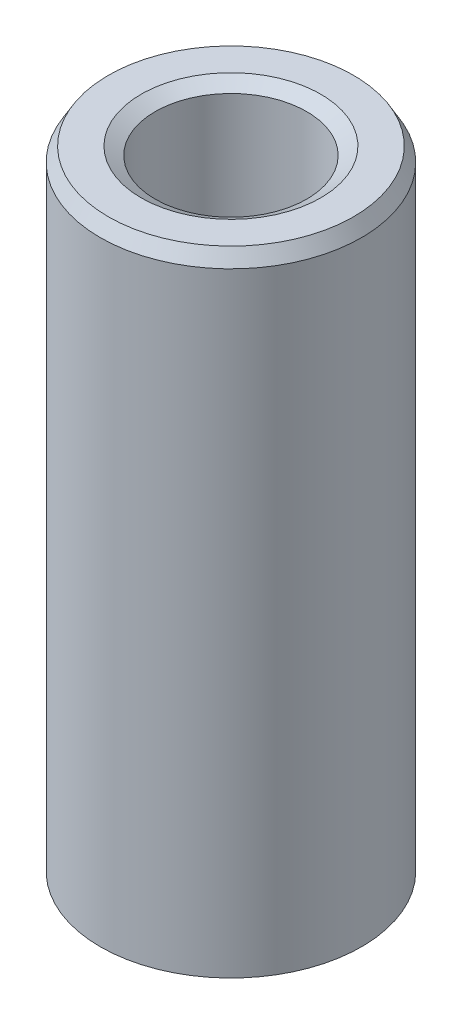
ISO-10303-21;
HEADER;
FILE_DESCRIPTION(('STEP AP214'),'2;1');
FILE_NAME('part.step','',(''),(''),'','','');
FILE_SCHEMA(('AUTOMOTIVE_DESIGN { 1 0 10303 214 1 1 1 1 }'));
ENDSEC;
DATA;
#1=APPLICATION_CONTEXT('core data for automotive mechanical design processes');
#2=APPLICATION_PROTOCOL_DEFINITION('international standard','automotive_design',2000,#1);
#3=PRODUCT_CONTEXT('',#1,'mechanical');
#4=PRODUCT('Part','Part','',(#3));
#5=PRODUCT_RELATED_PRODUCT_CATEGORY('part','',(#4));
#6=PRODUCT_DEFINITION_FORMATION('','',#4);
#7=PRODUCT_DEFINITION_CONTEXT('part definition',#1,'design');
#8=PRODUCT_DEFINITION('design','',#6,#7);
#9=PRODUCT_DEFINITION_SHAPE('','',#8);
#10=(LENGTH_UNIT() NAMED_UNIT(*) SI_UNIT(.MILLI.,.METRE.));
#11=(NAMED_UNIT(*) PLANE_ANGLE_UNIT() SI_UNIT($,.RADIAN.));
#12=(NAMED_UNIT(*) SI_UNIT($,.STERADIAN.) SOLID_ANGLE_UNIT());
#13=UNCERTAINTY_MEASURE_WITH_UNIT(LENGTH_MEASURE(1.E-05),#10,'distance_accuracy_value','');
#14=(GEOMETRIC_REPRESENTATION_CONTEXT(3) GLOBAL_UNCERTAINTY_ASSIGNED_CONTEXT((#13)) GLOBAL_UNIT_ASSIGNED_CONTEXT((#10,
#11,#12)) REPRESENTATION_CONTEXT('',''));
#15=CARTESIAN_POINT('',(0.,0.,0.));
#16=DIRECTION('',(0.,0.,1.));
#17=DIRECTION('',(1.,0.,0.));
#18=AXIS2_PLACEMENT_3D('',#15,#16,#17);
#19=CARTESIAN_POINT('',(0.,158.24779856527,0.));
#20=DIRECTION('',(0.,-1.,0.));
#21=DIRECTION('',(0.,0.,-1.));
#22=AXIS2_PLACEMENT_3D('',#19,#20,#21);
#23=CYLINDRICAL_SURFACE('',#22,32.5);
#24=CARTESIAN_POINT('',(0.,2.00878461288884,0.));
#25=DIRECTION('',(0.,1.,0.));
#26=DIRECTION('',(0.,0.,1.));
#27=AXIS2_PLACEMENT_3D('',#24,#25,#26);
#28=CIRCLE('',#27,32.5);
#29=CARTESIAN_POINT('',(0.,2.00878461288884,32.5));
#30=VERTEX_POINT('',#29);
#31=EDGE_CURVE('E10',#30,#30,#28,.T.);
#32=ORIENTED_EDGE('',*,*,#31,.T.);
#33=EDGE_LOOP('',(#32));
#34=FACE_BOUND('',#33,.T.);
#35=CARTESIAN_POINT('',(0.,154.768481554284,0.));
#36=DIRECTION('',(0.,1.,0.));
#37=DIRECTION('',(0.,0.,1.));
#38=AXIS2_PLACEMENT_3D('',#35,#36,#37);
#39=CIRCLE('',#38,32.5);
#40=CARTESIAN_POINT('',(0.,154.768481554284,32.5));
#41=VERTEX_POINT('',#40);
#42=EDGE_CURVE('E50',#41,#41,#39,.F.);
#43=ORIENTED_EDGE('',*,*,#42,.T.);
#44=EDGE_LOOP('',(#43));
#45=FACE_BOUND('',#44,.T.);
#46=ADVANCED_FACE('F39',(#34,#45),#23,.T.);
#47=CARTESIAN_POINT('',(0.,158.24779856527,0.));
#48=DIRECTION('',(0.,1.,0.));
#49=DIRECTION('',(0.,0.,1.));
#50=AXIS2_PLACEMENT_3D('',#47,#48,#49);
#51=PLANE('',#50);
#52=CARTESIAN_POINT('',(0.,158.24779856527,0.));
#53=DIRECTION('',(0.,1.,0.));
#54=DIRECTION('',(0.,0.,1.));
#55=AXIS2_PLACEMENT_3D('',#52,#53,#54);
#56=CIRCLE('',#55,22.3412010583184);
#57=CARTESIAN_POINT('',(0.,158.24779856527,22.3412010583184));
#58=VERTEX_POINT('',#57);
#59=EDGE_CURVE('E58',#58,#58,#56,.F.);
#60=ORIENTED_EDGE('',*,*,#59,.T.);
#61=EDGE_LOOP('',(#60));
#62=FACE_BOUND('',#61,.T.);
#63=CARTESIAN_POINT('',(0.,158.24779856527,0.));
#64=DIRECTION('',(0.,1.,0.));
#65=DIRECTION('',(0.,0.,1.));
#66=AXIS2_PLACEMENT_3D('',#63,#64,#65);
#67=CIRCLE('',#66,30.4912153871112);
#68=CARTESIAN_POINT('',(0.,158.24779856527,30.4912153871112));
#69=VERTEX_POINT('',#68);
#70=EDGE_CURVE('E61',#69,#69,#67,.T.);
#71=ORIENTED_EDGE('',*,*,#70,.T.);
#72=EDGE_LOOP('',(#71));
#73=FACE_BOUND('',#72,.T.);
#74=ADVANCED_FACE('F88',(#62,#73),#51,.T.);
#75=CARTESIAN_POINT('',(0.,0.,0.));
#76=DIRECTION('',(0.,1.,0.));
#77=DIRECTION('',(0.,0.,1.));
#78=AXIS2_PLACEMENT_3D('',#75,#76,#77);
#79=PLANE('',#78);
#80=CARTESIAN_POINT('',(0.,0.,0.));
#81=DIRECTION('',(0.,1.,0.));
#82=DIRECTION('',(0.,0.,1.));
#83=AXIS2_PLACEMENT_3D('',#80,#81,#82);
#84=CIRCLE('',#83,20.8706686602211);
#85=CARTESIAN_POINT('',(0.,0.,20.8706686602211));
#86=VERTEX_POINT('',#85);
#87=EDGE_CURVE('E51',#86,#86,#84,.T.);
#88=ORIENTED_EDGE('',*,*,#87,.T.);
#89=EDGE_LOOP('',(#88));
#90=FACE_BOUND('',#89,.T.);
#91=CARTESIAN_POINT('',(0.,0.,0.));
#92=DIRECTION('',(0.,1.,0.));
#93=DIRECTION('',(0.,0.,1.));
#94=AXIS2_PLACEMENT_3D('',#91,#92,#93);
#95=CIRCLE('',#94,29.0206829890139);
#96=CARTESIAN_POINT('',(0.,0.,29.0206829890139));
#97=VERTEX_POINT('',#96);
#98=EDGE_CURVE('E54',#97,#97,#95,.F.);
#99=ORIENTED_EDGE('',*,*,#98,.T.);
#100=EDGE_LOOP('',(#99));
#101=FACE_BOUND('',#100,.T.);
#102=ADVANCED_FACE('F83',(#90,#101),#79,.F.);
#103=CARTESIAN_POINT('',(0.,158.24779856527,0.));
#104=DIRECTION('',(0.,-1.,0.));
#105=DIRECTION('',(0.,0.,-1.));
#106=AXIS2_PLACEMENT_3D('',#103,#104,#105);
#107=CYLINDRICAL_SURFACE('',#106,18.8618840473323);
#108=CARTESIAN_POINT('',(0.,156.239013952381,0.));
#109=DIRECTION('',(0.,1.,0.));
#110=DIRECTION('',(0.,0.,1.));
#111=AXIS2_PLACEMENT_3D('',#108,#109,#110);
#112=CIRCLE('',#111,18.8618840473323);
#113=CARTESIAN_POINT('',(0.,156.239013952381,18.8618840473323));
#114=VERTEX_POINT('',#113);
#115=EDGE_CURVE('E67',#114,#114,#112,.T.);
#116=ORIENTED_EDGE('',*,*,#115,.T.);
#117=EDGE_LOOP('',(#116));
#118=FACE_BOUND('',#117,.T.);
#119=CARTESIAN_POINT('',(0.,3.47931701098611,0.));
#120=DIRECTION('',(0.,1.,0.));
#121=DIRECTION('',(0.,0.,1.));
#122=AXIS2_PLACEMENT_3D('',#119,#120,#121);
#123=CIRCLE('',#122,18.8618840473323);
#124=CARTESIAN_POINT('',(0.,3.47931701098611,18.8618840473323));
#125=VERTEX_POINT('',#124);
#126=EDGE_CURVE('E69',#125,#125,#123,.F.);
#127=ORIENTED_EDGE('',*,*,#126,.T.);
#128=EDGE_LOOP('',(#127));
#129=FACE_BOUND('',#128,.T.);
#130=ADVANCED_FACE('F71',(#118,#129),#107,.F.);
#131=CARTESIAN_POINT('',(0.,156.239013952381,0.));
#132=DIRECTION('',(0.,1.,0.));
#133=DIRECTION('',(0.,0.,1.));
#134=AXIS2_PLACEMENT_3D('',#131,#132,#133);
#135=CONICAL_SURFACE('',#134,18.8618840473323,1.0471975511966);
#136=ORIENTED_EDGE('',*,*,#59,.F.);
#137=EDGE_LOOP('',(#136));
#138=FACE_BOUND('',#137,.T.);
#139=ORIENTED_EDGE('',*,*,#115,.F.);
#140=EDGE_LOOP('',(#139));
#141=FACE_BOUND('',#140,.T.);
#142=ADVANCED_FACE('F77',(#138,#141),#135,.F.);
#143=CARTESIAN_POINT('',(0.,0.,0.));
#144=DIRECTION('',(0.,-1.,0.));
#145=DIRECTION('',(0.,0.,-1.));
#146=AXIS2_PLACEMENT_3D('',#143,#144,#145);
#147=CONICAL_SURFACE('',#146,20.8706686602211,0.523598775598297);
#148=ORIENTED_EDGE('',*,*,#126,.F.);
#149=EDGE_LOOP('',(#148));
#150=FACE_BOUND('',#149,.T.);
#151=ORIENTED_EDGE('',*,*,#87,.F.);
#152=EDGE_LOOP('',(#151));
#153=FACE_BOUND('',#152,.T.);
#154=ADVANCED_FACE('F73',(#150,#153),#147,.F.);
#155=CARTESIAN_POINT('',(0.,2.00878461288884,0.));
#156=DIRECTION('',(0.,1.,0.));
#157=DIRECTION('',(0.,0.,1.));
#158=AXIS2_PLACEMENT_3D('',#155,#156,#157);
#159=CONICAL_SURFACE('',#158,32.5,1.0471975511966);
#160=ORIENTED_EDGE('',*,*,#98,.F.);
#161=EDGE_LOOP('',(#160));
#162=FACE_BOUND('',#161,.T.);
#163=ORIENTED_EDGE('',*,*,#31,.F.);
#164=EDGE_LOOP('',(#163));
#165=FACE_BOUND('',#164,.T.);
#166=ADVANCED_FACE('F76',(#162,#165),#159,.T.);
#167=CARTESIAN_POINT('',(0.,158.24779856527,0.));
#168=DIRECTION('',(0.,-1.,0.));
#169=DIRECTION('',(0.,0.,-1.));
#170=AXIS2_PLACEMENT_3D('',#167,#168,#169);
#171=CONICAL_SURFACE('',#170,30.4912153871112,0.523598775598295);
#172=ORIENTED_EDGE('',*,*,#42,.F.);
#173=EDGE_LOOP('',(#172));
#174=FACE_BOUND('',#173,.T.);
#175=ORIENTED_EDGE('',*,*,#70,.F.);
#176=EDGE_LOOP('',(#175));
#177=FACE_BOUND('',#176,.T.);
#178=ADVANCED_FACE('F45',(#174,#177),#171,.T.);
#179=CLOSED_SHELL('',(#46,#74,#102,#130,#142,#154,#166,#178));
#180=MANIFOLD_SOLID_BREP('B2',#179);
#181=ADVANCED_BREP_SHAPE_REPRESENTATION('',(#18,#180),#14);
#182=SHAPE_DEFINITION_REPRESENTATION(#9,#181);
ENDSEC;
END-ISO-10303-21;
